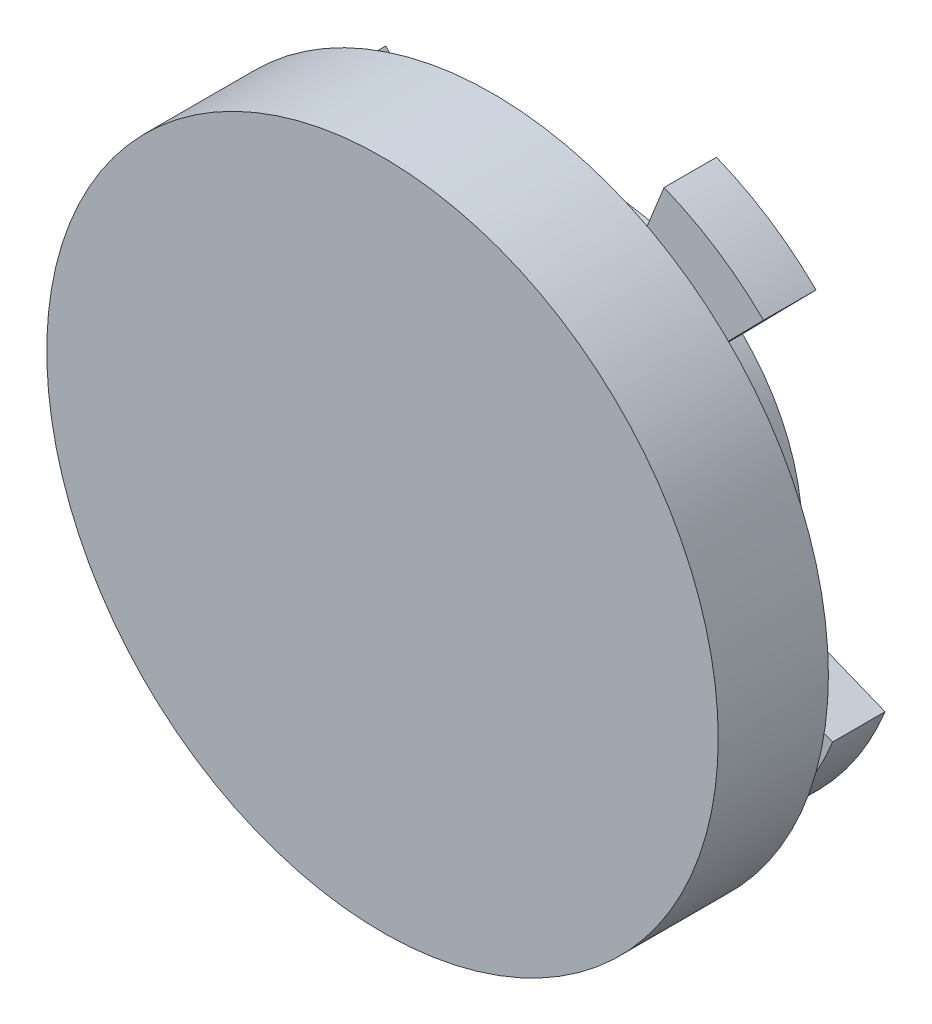
ISO-10303-21;
HEADER;
FILE_DESCRIPTION(('STEP AP214'),'2;1');
FILE_NAME('part.step','',(''),(''),'','','');
FILE_SCHEMA(('AUTOMOTIVE_DESIGN { 1 0 10303 214 1 1 1 1 }'));
ENDSEC;
DATA;
#1=APPLICATION_CONTEXT('core data for automotive mechanical design processes');
#2=APPLICATION_PROTOCOL_DEFINITION('international standard','automotive_design',2000,#1);
#3=PRODUCT_CONTEXT('',#1,'mechanical');
#4=PRODUCT('Part','Part','',(#3));
#5=PRODUCT_RELATED_PRODUCT_CATEGORY('part','',(#4));
#6=PRODUCT_DEFINITION_FORMATION('','',#4);
#7=PRODUCT_DEFINITION_CONTEXT('part definition',#1,'design');
#8=PRODUCT_DEFINITION('design','',#6,#7);
#9=PRODUCT_DEFINITION_SHAPE('','',#8);
#10=(LENGTH_UNIT() NAMED_UNIT(*) SI_UNIT(.MILLI.,.METRE.));
#11=(NAMED_UNIT(*) PLANE_ANGLE_UNIT() SI_UNIT($,.RADIAN.));
#12=(NAMED_UNIT(*) SI_UNIT($,.STERADIAN.) SOLID_ANGLE_UNIT());
#13=UNCERTAINTY_MEASURE_WITH_UNIT(LENGTH_MEASURE(1.E-05),#10,'distance_accuracy_value','');
#14=(GEOMETRIC_REPRESENTATION_CONTEXT(3) GLOBAL_UNCERTAINTY_ASSIGNED_CONTEXT((#13)) GLOBAL_UNIT_ASSIGNED_CONTEXT((#10,
#11,#12)) REPRESENTATION_CONTEXT('',''));
#15=CARTESIAN_POINT('',(0.,0.,0.));
#16=DIRECTION('',(0.,0.,1.));
#17=DIRECTION('',(1.,0.,0.));
#18=AXIS2_PLACEMENT_3D('',#15,#16,#17);
#19=CARTESIAN_POINT('',(0.,0.,2.5));
#20=DIRECTION('',(0.,0.,-1.));
#21=DIRECTION('',(-1.,0.,0.));
#22=AXIS2_PLACEMENT_3D('',#19,#20,#21);
#23=CYLINDRICAL_SURFACE('',#22,9.5);
#24=CARTESIAN_POINT('',(0.,0.,0.));
#25=DIRECTION('',(0.,0.,1.));
#26=DIRECTION('',(1.,0.,0.));
#27=AXIS2_PLACEMENT_3D('',#24,#25,#26);
#28=CIRCLE('',#27,9.5);
#29=CARTESIAN_POINT('',(8.81195121073412,-3.54957967365734,0.));
#30=VERTEX_POINT('',#29);
#31=CARTESIAN_POINT('',(6.6563059929086,6.77817014604746,0.));
#32=VERTEX_POINT('',#31);
#33=EDGE_CURVE('E105',#30,#32,#28,.T.);
#34=ORIENTED_EDGE('',*,*,#33,.T.);
#35=DIRECTION('',(0.,0.,-1.));
#36=VECTOR('',#35,1.);
#37=CARTESIAN_POINT('',(6.6563059929086,6.77817014604746,2.5));
#38=LINE('',#37,#36);
#39=CARTESIAN_POINT('',(6.6563059929086,6.77817014604746,2.5));
#40=VERTEX_POINT('',#39);
#41=EDGE_CURVE('E218',#40,#32,#38,.T.);
#42=ORIENTED_EDGE('',*,*,#41,.F.);
#43=CARTESIAN_POINT('',(0.,0.,2.5));
#44=DIRECTION('',(0.,0.,1.));
#45=DIRECTION('',(1.,0.,0.));
#46=AXIS2_PLACEMENT_3D('',#43,#44,#45);
#47=CIRCLE('',#46,9.5);
#48=CARTESIAN_POINT('',(3.54957967365734,8.81195121073412,2.5));
#49=VERTEX_POINT('',#48);
#50=EDGE_CURVE('E189',#40,#49,#47,.T.);
#51=ORIENTED_EDGE('',*,*,#50,.T.);
#52=DIRECTION('',(0.,0.,-1.));
#53=VECTOR('',#52,1.);
#54=CARTESIAN_POINT('',(3.54957967365734,8.81195121073412,2.5));
#55=LINE('',#54,#53);
#56=CARTESIAN_POINT('',(3.54957967365734,8.81195121073412,0.));
#57=VERTEX_POINT('',#56);
#58=EDGE_CURVE('E249',#49,#57,#55,.T.);
#59=ORIENTED_EDGE('',*,*,#58,.T.);
#60=CARTESIAN_POINT('',(0.,0.,0.));
#61=DIRECTION('',(0.,0.,1.));
#62=DIRECTION('',(1.,0.,0.));
#63=AXIS2_PLACEMENT_3D('',#60,#61,#62);
#64=CIRCLE('',#63,9.5);
#65=CARTESIAN_POINT('',(-6.77817014604745,6.6563059929086,0.));
#66=VERTEX_POINT('',#65);
#67=EDGE_CURVE('E191',#57,#66,#64,.T.);
#68=ORIENTED_EDGE('',*,*,#67,.T.);
#69=DIRECTION('',(0.,0.,-1.));
#70=VECTOR('',#69,1.);
#71=CARTESIAN_POINT('',(-6.77817014604745,6.6563059929086,2.5));
#72=LINE('',#71,#70);
#73=CARTESIAN_POINT('',(-6.77817014604745,6.6563059929086,2.5));
#74=VERTEX_POINT('',#73);
#75=EDGE_CURVE('E246',#74,#66,#72,.T.);
#76=ORIENTED_EDGE('',*,*,#75,.F.);
#77=CARTESIAN_POINT('',(-8.81195121073413,3.54957967365734,2.5));
#78=VERTEX_POINT('',#77);
#79=EDGE_CURVE('E42',#74,#78,#47,.T.);
#80=ORIENTED_EDGE('',*,*,#79,.T.);
#81=DIRECTION('',(0.,0.,-1.));
#82=VECTOR('',#81,1.);
#83=CARTESIAN_POINT('',(-8.81195121073413,3.54957967365734,2.5));
#84=LINE('',#83,#82);
#85=CARTESIAN_POINT('',(-8.81195121073413,3.54957967365734,0.));
#86=VERTEX_POINT('',#85);
#87=EDGE_CURVE('E237',#78,#86,#84,.T.);
#88=ORIENTED_EDGE('',*,*,#87,.T.);
#89=CARTESIAN_POINT('',(0.,0.,0.));
#90=DIRECTION('',(0.,0.,1.));
#91=DIRECTION('',(1.,0.,0.));
#92=AXIS2_PLACEMENT_3D('',#89,#90,#91);
#93=CIRCLE('',#92,9.5);
#94=CARTESIAN_POINT('',(-6.6563059929086,-6.77817014604745,0.));
#95=VERTEX_POINT('',#94);
#96=EDGE_CURVE('E199',#86,#95,#93,.T.);
#97=ORIENTED_EDGE('',*,*,#96,.T.);
#98=DIRECTION('',(0.,0.,-1.));
#99=VECTOR('',#98,1.);
#100=CARTESIAN_POINT('',(-6.6563059929086,-6.77817014604745,2.5));
#101=LINE('',#100,#99);
#102=CARTESIAN_POINT('',(-6.6563059929086,-6.77817014604745,2.5));
#103=VERTEX_POINT('',#102);
#104=EDGE_CURVE('E234',#103,#95,#101,.T.);
#105=ORIENTED_EDGE('',*,*,#104,.F.);
#106=CARTESIAN_POINT('',(-3.54957967365734,-8.81195121073412,2.5));
#107=VERTEX_POINT('',#106);
#108=EDGE_CURVE('E254',#103,#107,#47,.T.);
#109=ORIENTED_EDGE('',*,*,#108,.T.);
#110=DIRECTION('',(0.,0.,-1.));
#111=VECTOR('',#110,1.);
#112=CARTESIAN_POINT('',(-3.54957967365734,-8.81195121073412,2.5));
#113=LINE('',#112,#111);
#114=CARTESIAN_POINT('',(-3.54957967365734,-8.81195121073412,0.));
#115=VERTEX_POINT('',#114);
#116=EDGE_CURVE('E225',#107,#115,#113,.T.);
#117=ORIENTED_EDGE('',*,*,#116,.T.);
#118=CARTESIAN_POINT('',(0.,0.,0.));
#119=DIRECTION('',(0.,0.,1.));
#120=DIRECTION('',(1.,0.,0.));
#121=AXIS2_PLACEMENT_3D('',#118,#119,#120);
#122=CIRCLE('',#121,9.5);
#123=CARTESIAN_POINT('',(6.77817014604745,-6.6563059929086,0.));
#124=VERTEX_POINT('',#123);
#125=EDGE_CURVE('E207',#115,#124,#122,.T.);
#126=ORIENTED_EDGE('',*,*,#125,.T.);
#127=DIRECTION('',(0.,0.,-1.));
#128=VECTOR('',#127,1.);
#129=CARTESIAN_POINT('',(6.77817014604745,-6.6563059929086,2.5));
#130=LINE('',#129,#128);
#131=CARTESIAN_POINT('',(6.77817014604745,-6.6563059929086,2.5));
#132=VERTEX_POINT('',#131);
#133=EDGE_CURVE('E222',#132,#124,#130,.T.);
#134=ORIENTED_EDGE('',*,*,#133,.F.);
#135=CARTESIAN_POINT('',(8.81195121073412,-3.54957967365734,2.5));
#136=VERTEX_POINT('',#135);
#137=EDGE_CURVE('E252',#132,#136,#47,.T.);
#138=ORIENTED_EDGE('',*,*,#137,.T.);
#139=DIRECTION('',(0.,0.,-1.));
#140=VECTOR('',#139,1.);
#141=CARTESIAN_POINT('',(8.81195121073412,-3.54957967365734,2.5));
#142=LINE('',#141,#140);
#143=EDGE_CURVE('E176',#136,#30,#142,.T.);
#144=ORIENTED_EDGE('',*,*,#143,.T.);
#145=EDGE_LOOP('',(#34,#42,#51,#59,#68,#76,#80,#88,#97,#105,#109,#117,#126,#134,#138,#144));
#146=FACE_BOUND('',#145,.T.);
#147=CARTESIAN_POINT('',(0.,0.,5.25));
#148=DIRECTION('',(0.,0.,1.));
#149=DIRECTION('',(1.,0.,0.));
#150=AXIS2_PLACEMENT_3D('',#147,#148,#149);
#151=CIRCLE('',#150,9.5);
#152=CARTESIAN_POINT('',(9.5,0.,5.25));
#153=VERTEX_POINT('',#152);
#154=EDGE_CURVE('E11',#153,#153,#151,.T.);
#155=ORIENTED_EDGE('',*,*,#154,.F.);
#156=EDGE_LOOP('',(#155));
#157=FACE_BOUND('',#156,.T.);
#158=ADVANCED_FACE('F33',(#146,#157),#23,.T.);
#159=CARTESIAN_POINT('',(0.,0.,2.5));
#160=DIRECTION('',(0.,0.,1.));
#161=DIRECTION('',(1.,0.,0.));
#162=AXIS2_PLACEMENT_3D('',#159,#160,#161);
#163=PLANE('',#162);
#164=ORIENTED_EDGE('',*,*,#50,.F.);
#165=DIRECTION('',(0.700663788727222,0.713491594320784,0.));
#166=VECTOR('',#165,1.);
#167=CARTESIAN_POINT('',(10.1596249365447,10.3456281176514,2.5));
#168=LINE('',#167,#166);
#169=CARTESIAN_POINT('',(10.1596249365447,10.3456281176514,2.5));
#170=VERTEX_POINT('',#169);
#171=EDGE_CURVE('E50',#40,#170,#168,.T.);
#172=ORIENTED_EDGE('',*,*,#171,.T.);
#173=CARTESIAN_POINT('',(0.,0.,2.5));
#174=DIRECTION('',(0.,0.,1.));
#175=DIRECTION('',(1.,0.,0.));
#176=AXIS2_PLACEMENT_3D('',#173,#174,#175);
#177=CIRCLE('',#176,14.5);
#178=CARTESIAN_POINT('',(5.41777950189805,13.4498202690152,2.5));
#179=VERTEX_POINT('',#178);
#180=EDGE_CURVE('E216',#170,#179,#177,.T.);
#181=ORIENTED_EDGE('',*,*,#180,.T.);
#182=DIRECTION('',(-0.373639965648141,-0.927573811656224,0.));
#183=VECTOR('',#182,1.);
#184=CARTESIAN_POINT('',(5.41777950189805,13.4498202690152,2.5));
#185=LINE('',#184,#183);
#186=EDGE_CURVE('E120',#179,#49,#185,.T.);
#187=ORIENTED_EDGE('',*,*,#186,.T.);
#188=EDGE_LOOP('',(#164,#172,#181,#187));
#189=FACE_BOUND('',#188,.T.);
#190=ADVANCED_FACE('F325',(#189),#163,.T.);
#191=ORIENTED_EDGE('',*,*,#79,.F.);
#192=DIRECTION('',(-0.713491594320785,0.700663788727222,0.));
#193=VECTOR('',#192,1.);
#194=CARTESIAN_POINT('',(-10.3456281176514,10.1596249365447,2.5));
#195=LINE('',#194,#193);
#196=CARTESIAN_POINT('',(-10.3456281176514,10.1596249365447,2.5));
#197=VERTEX_POINT('',#196);
#198=EDGE_CURVE('E272',#74,#197,#195,.T.);
#199=ORIENTED_EDGE('',*,*,#198,.T.);
#200=CARTESIAN_POINT('',(0.,0.,2.5));
#201=DIRECTION('',(0.,0.,1.));
#202=DIRECTION('',(1.,0.,0.));
#203=AXIS2_PLACEMENT_3D('',#200,#201,#202);
#204=CIRCLE('',#203,14.5);
#205=CARTESIAN_POINT('',(-13.4498202690152,5.41777950189804,2.5));
#206=VERTEX_POINT('',#205);
#207=EDGE_CURVE('E277',#197,#206,#204,.T.);
#208=ORIENTED_EDGE('',*,*,#207,.T.);
#209=DIRECTION('',(0.927573811656224,-0.373639965648141,0.));
#210=VECTOR('',#209,1.);
#211=CARTESIAN_POINT('',(-13.4498202690152,5.41777950189804,2.5));
#212=LINE('',#211,#210);
#213=EDGE_CURVE('E275',#206,#78,#212,.T.);
#214=ORIENTED_EDGE('',*,*,#213,.T.);
#215=EDGE_LOOP('',(#191,#199,#208,#214));
#216=FACE_BOUND('',#215,.T.);
#217=ADVANCED_FACE('F271',(#216),#163,.T.);
#218=ORIENTED_EDGE('',*,*,#108,.F.);
#219=DIRECTION('',(-0.700663788727222,-0.713491594320784,0.));
#220=VECTOR('',#219,1.);
#221=CARTESIAN_POINT('',(-10.1596249365447,-10.3456281176514,2.5));
#222=LINE('',#221,#220);
#223=CARTESIAN_POINT('',(-10.1596249365447,-10.3456281176514,2.5));
#224=VERTEX_POINT('',#223);
#225=EDGE_CURVE('E280',#103,#224,#222,.T.);
#226=ORIENTED_EDGE('',*,*,#225,.T.);
#227=CARTESIAN_POINT('',(0.,0.,2.5));
#228=DIRECTION('',(0.,0.,1.));
#229=DIRECTION('',(1.,0.,0.));
#230=AXIS2_PLACEMENT_3D('',#227,#228,#229);
#231=CIRCLE('',#230,14.5);
#232=CARTESIAN_POINT('',(-5.41777950189805,-13.4498202690152,2.5));
#233=VERTEX_POINT('',#232);
#234=EDGE_CURVE('E298',#224,#233,#231,.T.);
#235=ORIENTED_EDGE('',*,*,#234,.T.);
#236=DIRECTION('',(0.37363996564814,0.927573811656224,0.));
#237=VECTOR('',#236,1.);
#238=CARTESIAN_POINT('',(-5.41777950189804,-13.4498202690152,2.5));
#239=LINE('',#238,#237);
#240=EDGE_CURVE('E300',#233,#107,#239,.T.);
#241=ORIENTED_EDGE('',*,*,#240,.T.);
#242=EDGE_LOOP('',(#218,#226,#235,#241));
#243=FACE_BOUND('',#242,.T.);
#244=ADVANCED_FACE('F306',(#243),#163,.T.);
#245=CARTESIAN_POINT('',(0.,0.,2.5));
#246=DIRECTION('',(0.,0.,-1.));
#247=DIRECTION('',(-1.,0.,0.));
#248=AXIS2_PLACEMENT_3D('',#245,#246,#247);
#249=CYLINDRICAL_SURFACE('',#248,14.5);
#250=CARTESIAN_POINT('',(0.,0.,0.));
#251=DIRECTION('',(0.,0.,1.));
#252=DIRECTION('',(1.,0.,0.));
#253=AXIS2_PLACEMENT_3D('',#250,#251,#252);
#254=CIRCLE('',#253,14.5);
#255=CARTESIAN_POINT('',(10.1596249365447,10.3456281176514,0.));
#256=VERTEX_POINT('',#255);
#257=CARTESIAN_POINT('',(5.41777950189805,13.4498202690152,0.));
#258=VERTEX_POINT('',#257);
#259=EDGE_CURVE('E185',#256,#258,#254,.T.);
#260=ORIENTED_EDGE('',*,*,#259,.T.);
#261=DIRECTION('',(0.,0.,-1.));
#262=VECTOR('',#261,1.);
#263=CARTESIAN_POINT('',(5.41777950189805,13.4498202690152,2.5));
#264=LINE('',#263,#262);
#265=EDGE_CURVE('E251',#179,#258,#264,.T.);
#266=ORIENTED_EDGE('',*,*,#265,.F.);
#267=ORIENTED_EDGE('',*,*,#180,.F.);
#268=DIRECTION('',(0.,0.,-1.));
#269=VECTOR('',#268,1.);
#270=CARTESIAN_POINT('',(10.1596249365447,10.3456281176514,2.5));
#271=LINE('',#270,#269);
#272=EDGE_CURVE('E181',#170,#256,#271,.T.);
#273=ORIENTED_EDGE('',*,*,#272,.T.);
#274=EDGE_LOOP('',(#260,#266,#267,#273));
#275=FACE_BOUND('',#274,.T.);
#276=ADVANCED_FACE('F35',(#275),#249,.T.);
#277=CARTESIAN_POINT('',(5.41777950189805,13.4498202690152,2.5));
#278=DIRECTION('',(0.927573811656224,-0.373639965648141,0.));
#279=DIRECTION('',(0.373639965648141,0.927573811656224,0.));
#280=AXIS2_PLACEMENT_3D('',#277,#278,#279);
#281=PLANE('',#280);
#282=DIRECTION('',(-0.373639965648141,-0.927573811656224,0.));
#283=VECTOR('',#282,1.);
#284=CARTESIAN_POINT('',(5.41777950189805,13.4498202690152,0.));
#285=LINE('',#284,#283);
#286=EDGE_CURVE('E188',#258,#57,#285,.T.);
#287=ORIENTED_EDGE('',*,*,#286,.T.);
#288=ORIENTED_EDGE('',*,*,#58,.F.);
#289=ORIENTED_EDGE('',*,*,#186,.F.);
#290=ORIENTED_EDGE('',*,*,#265,.T.);
#291=EDGE_LOOP('',(#287,#288,#289,#290));
#292=FACE_BOUND('',#291,.T.);
#293=ADVANCED_FACE('F352',(#292),#281,.F.);
#294=CARTESIAN_POINT('',(-10.3456281176514,10.1596249365447,2.5));
#295=DIRECTION('',(-0.700663788727222,-0.713491594320785,0.));
#296=DIRECTION('',(0.713491594320785,-0.700663788727222,0.));
#297=AXIS2_PLACEMENT_3D('',#294,#295,#296);
#298=PLANE('',#297);
#299=DIRECTION('',(-0.713491594320785,0.700663788727222,0.));
#300=VECTOR('',#299,1.);
#301=CARTESIAN_POINT('',(-10.3456281176514,10.1596249365447,0.));
#302=LINE('',#301,#300);
#303=CARTESIAN_POINT('',(-10.3456281176514,10.1596249365447,0.));
#304=VERTEX_POINT('',#303);
#305=EDGE_CURVE('E193',#66,#304,#302,.T.);
#306=ORIENTED_EDGE('',*,*,#305,.T.);
#307=DIRECTION('',(0.,0.,-1.));
#308=VECTOR('',#307,1.);
#309=CARTESIAN_POINT('',(-10.3456281176514,10.1596249365447,2.5));
#310=LINE('',#309,#308);
#311=EDGE_CURVE('E243',#197,#304,#310,.T.);
#312=ORIENTED_EDGE('',*,*,#311,.F.);
#313=ORIENTED_EDGE('',*,*,#198,.F.);
#314=ORIENTED_EDGE('',*,*,#75,.T.);
#315=EDGE_LOOP('',(#306,#312,#313,#314));
#316=FACE_BOUND('',#315,.T.);
#317=ADVANCED_FACE('F404',(#316),#298,.F.);
#318=CARTESIAN_POINT('',(0.,0.,2.5));
#319=DIRECTION('',(0.,0.,-1.));
#320=DIRECTION('',(-1.,0.,0.));
#321=AXIS2_PLACEMENT_3D('',#318,#319,#320);
#322=CYLINDRICAL_SURFACE('',#321,14.5);
#323=CARTESIAN_POINT('',(0.,0.,0.));
#324=DIRECTION('',(0.,0.,1.));
#325=DIRECTION('',(1.,0.,0.));
#326=AXIS2_PLACEMENT_3D('',#323,#324,#325);
#327=CIRCLE('',#326,14.5);
#328=CARTESIAN_POINT('',(-13.4498202690152,5.41777950189804,0.));
#329=VERTEX_POINT('',#328);
#330=EDGE_CURVE('E195',#304,#329,#327,.T.);
#331=ORIENTED_EDGE('',*,*,#330,.T.);
#332=DIRECTION('',(0.,0.,-1.));
#333=VECTOR('',#332,1.);
#334=CARTESIAN_POINT('',(-13.4498202690152,5.41777950189804,2.5));
#335=LINE('',#334,#333);
#336=EDGE_CURVE('E240',#206,#329,#335,.T.);
#337=ORIENTED_EDGE('',*,*,#336,.F.);
#338=ORIENTED_EDGE('',*,*,#207,.F.);
#339=ORIENTED_EDGE('',*,*,#311,.T.);
#340=EDGE_LOOP('',(#331,#337,#338,#339));
#341=FACE_BOUND('',#340,.T.);
#342=ADVANCED_FACE('F399',(#341),#322,.T.);
#343=CARTESIAN_POINT('',(-13.4498202690152,5.41777950189804,2.5));
#344=DIRECTION('',(0.373639965648141,0.927573811656224,0.));
#345=DIRECTION('',(-0.927573811656224,0.373639965648141,0.));
#346=AXIS2_PLACEMENT_3D('',#343,#344,#345);
#347=PLANE('',#346);
#348=DIRECTION('',(0.927573811656224,-0.373639965648141,0.));
#349=VECTOR('',#348,1.);
#350=CARTESIAN_POINT('',(-13.4498202690152,5.41777950189804,0.));
#351=LINE('',#350,#349);
#352=EDGE_CURVE('E197',#329,#86,#351,.T.);
#353=ORIENTED_EDGE('',*,*,#352,.T.);
#354=ORIENTED_EDGE('',*,*,#87,.F.);
#355=ORIENTED_EDGE('',*,*,#213,.F.);
#356=ORIENTED_EDGE('',*,*,#336,.T.);
#357=EDGE_LOOP('',(#353,#354,#355,#356));
#358=FACE_BOUND('',#357,.T.);
#359=ADVANCED_FACE('F282',(#358),#347,.F.);
#360=CARTESIAN_POINT('',(-10.1596249365447,-10.3456281176514,2.5));
#361=DIRECTION('',(0.713491594320784,-0.700663788727222,0.));
#362=DIRECTION('',(0.700663788727222,0.713491594320784,0.));
#363=AXIS2_PLACEMENT_3D('',#360,#361,#362);
#364=PLANE('',#363);
#365=DIRECTION('',(-0.700663788727222,-0.713491594320784,0.));
#366=VECTOR('',#365,1.);
#367=CARTESIAN_POINT('',(-10.1596249365447,-10.3456281176514,0.));
#368=LINE('',#367,#366);
#369=CARTESIAN_POINT('',(-10.1596249365447,-10.3456281176514,0.));
#370=VERTEX_POINT('',#369);
#371=EDGE_CURVE('E201',#95,#370,#368,.T.);
#372=ORIENTED_EDGE('',*,*,#371,.T.);
#373=DIRECTION('',(0.,0.,-1.));
#374=VECTOR('',#373,1.);
#375=CARTESIAN_POINT('',(-10.1596249365447,-10.3456281176514,2.5));
#376=LINE('',#375,#374);
#377=EDGE_CURVE('E231',#224,#370,#376,.T.);
#378=ORIENTED_EDGE('',*,*,#377,.F.);
#379=ORIENTED_EDGE('',*,*,#225,.F.);
#380=ORIENTED_EDGE('',*,*,#104,.T.);
#381=EDGE_LOOP('',(#372,#378,#379,#380));
#382=FACE_BOUND('',#381,.T.);
#383=ADVANCED_FACE('F294',(#382),#364,.F.);
#384=CARTESIAN_POINT('',(0.,0.,2.5));
#385=DIRECTION('',(0.,0.,-1.));
#386=DIRECTION('',(-1.,0.,0.));
#387=AXIS2_PLACEMENT_3D('',#384,#385,#386);
#388=CYLINDRICAL_SURFACE('',#387,14.5);
#389=CARTESIAN_POINT('',(0.,0.,0.));
#390=DIRECTION('',(0.,0.,1.));
#391=DIRECTION('',(1.,0.,0.));
#392=AXIS2_PLACEMENT_3D('',#389,#390,#391);
#393=CIRCLE('',#392,14.5);
#394=CARTESIAN_POINT('',(-5.41777950189805,-13.4498202690152,0.));
#395=VERTEX_POINT('',#394);
#396=EDGE_CURVE('E203',#370,#395,#393,.T.);
#397=ORIENTED_EDGE('',*,*,#396,.T.);
#398=DIRECTION('',(0.,0.,-1.));
#399=VECTOR('',#398,1.);
#400=CARTESIAN_POINT('',(-5.41777950189805,-13.4498202690152,2.5));
#401=LINE('',#400,#399);
#402=EDGE_CURVE('E228',#233,#395,#401,.T.);
#403=ORIENTED_EDGE('',*,*,#402,.F.);
#404=ORIENTED_EDGE('',*,*,#234,.F.);
#405=ORIENTED_EDGE('',*,*,#377,.T.);
#406=EDGE_LOOP('',(#397,#403,#404,#405));
#407=FACE_BOUND('',#406,.T.);
#408=ADVANCED_FACE('F322',(#407),#388,.T.);
#409=CARTESIAN_POINT('',(-5.41777950189804,-13.4498202690152,2.5));
#410=DIRECTION('',(-0.927573811656224,0.37363996564814,0.));
#411=DIRECTION('',(-0.373639965648141,-0.927573811656224,0.));
#412=AXIS2_PLACEMENT_3D('',#409,#410,#411);
#413=PLANE('',#412);
#414=DIRECTION('',(0.37363996564814,0.927573811656224,0.));
#415=VECTOR('',#414,1.);
#416=CARTESIAN_POINT('',(-5.41777950189804,-13.4498202690152,0.));
#417=LINE('',#416,#415);
#418=EDGE_CURVE('E205',#395,#115,#417,.T.);
#419=ORIENTED_EDGE('',*,*,#418,.T.);
#420=ORIENTED_EDGE('',*,*,#116,.F.);
#421=ORIENTED_EDGE('',*,*,#240,.F.);
#422=ORIENTED_EDGE('',*,*,#402,.T.);
#423=EDGE_LOOP('',(#419,#420,#421,#422));
#424=FACE_BOUND('',#423,.T.);
#425=ADVANCED_FACE('F309',(#424),#413,.F.);
#426=CARTESIAN_POINT('',(10.3456281176514,-10.1596249365447,2.5));
#427=DIRECTION('',(0.700663788727222,0.713491594320784,0.));
#428=DIRECTION('',(-0.713491594320784,0.700663788727222,0.));
#429=AXIS2_PLACEMENT_3D('',#426,#427,#428);
#430=PLANE('',#429);
#431=DIRECTION('',(0.713491594320784,-0.700663788727222,0.));
#432=VECTOR('',#431,1.);
#433=CARTESIAN_POINT('',(10.3456281176514,-10.1596249365447,0.));
#434=LINE('',#433,#432);
#435=CARTESIAN_POINT('',(10.3456281176514,-10.1596249365447,0.));
#436=VERTEX_POINT('',#435);
#437=EDGE_CURVE('E209',#124,#436,#434,.T.);
#438=ORIENTED_EDGE('',*,*,#437,.T.);
#439=DIRECTION('',(0.,0.,-1.));
#440=VECTOR('',#439,1.);
#441=CARTESIAN_POINT('',(10.3456281176514,-10.1596249365447,2.5));
#442=LINE('',#441,#440);
#443=CARTESIAN_POINT('',(10.3456281176514,-10.1596249365447,2.5));
#444=VERTEX_POINT('',#443);
#445=EDGE_CURVE('E175',#444,#436,#442,.T.);
#446=ORIENTED_EDGE('',*,*,#445,.F.);
#447=DIRECTION('',(0.713491594320784,-0.700663788727222,0.));
#448=VECTOR('',#447,1.);
#449=CARTESIAN_POINT('',(10.3456281176514,-10.1596249365447,2.5));
#450=LINE('',#449,#448);
#451=EDGE_CURVE('E163',#132,#444,#450,.T.);
#452=ORIENTED_EDGE('',*,*,#451,.F.);
#453=ORIENTED_EDGE('',*,*,#133,.T.);
#454=EDGE_LOOP('',(#438,#446,#452,#453));
#455=FACE_BOUND('',#454,.T.);
#456=ADVANCED_FACE('F314',(#455),#430,.F.);
#457=CARTESIAN_POINT('',(0.,0.,2.5));
#458=DIRECTION('',(0.,0.,-1.));
#459=DIRECTION('',(-1.,0.,0.));
#460=AXIS2_PLACEMENT_3D('',#457,#458,#459);
#461=CYLINDRICAL_SURFACE('',#460,14.5);
#462=CARTESIAN_POINT('',(0.,0.,0.));
#463=DIRECTION('',(0.,0.,1.));
#464=DIRECTION('',(1.,0.,0.));
#465=AXIS2_PLACEMENT_3D('',#462,#463,#464);
#466=CIRCLE('',#465,14.5);
#467=CARTESIAN_POINT('',(13.4498202690152,-5.41777950189804,0.));
#468=VERTEX_POINT('',#467);
#469=EDGE_CURVE('E172',#436,#468,#466,.T.);
#470=ORIENTED_EDGE('',*,*,#469,.T.);
#471=DIRECTION('',(0.,0.,-1.));
#472=VECTOR('',#471,1.);
#473=CARTESIAN_POINT('',(13.4498202690152,-5.41777950189804,2.5));
#474=LINE('',#473,#472);
#475=CARTESIAN_POINT('',(13.4498202690152,-5.41777950189804,2.5));
#476=VERTEX_POINT('',#475);
#477=EDGE_CURVE('E169',#476,#468,#474,.T.);
#478=ORIENTED_EDGE('',*,*,#477,.F.);
#479=CARTESIAN_POINT('',(0.,0.,2.5));
#480=DIRECTION('',(0.,0.,1.));
#481=DIRECTION('',(1.,0.,0.));
#482=AXIS2_PLACEMENT_3D('',#479,#480,#481);
#483=CIRCLE('',#482,14.5);
#484=EDGE_CURVE('E156',#444,#476,#483,.T.);
#485=ORIENTED_EDGE('',*,*,#484,.F.);
#486=ORIENTED_EDGE('',*,*,#445,.T.);
#487=EDGE_LOOP('',(#470,#478,#485,#486));
#488=FACE_BOUND('',#487,.T.);
#489=ADVANCED_FACE('F170',(#488),#461,.T.);
#490=CARTESIAN_POINT('',(13.4498202690152,-5.41777950189804,2.5));
#491=DIRECTION('',(-0.373639965648141,-0.927573811656224,0.));
#492=DIRECTION('',(0.927573811656224,-0.373639965648141,0.));
#493=AXIS2_PLACEMENT_3D('',#490,#491,#492);
#494=PLANE('',#493);
#495=DIRECTION('',(-0.927573811656224,0.373639965648141,0.));
#496=VECTOR('',#495,1.);
#497=CARTESIAN_POINT('',(13.4498202690152,-5.41777950189804,0.));
#498=LINE('',#497,#496);
#499=EDGE_CURVE('E212',#468,#30,#498,.T.);
#500=ORIENTED_EDGE('',*,*,#499,.T.);
#501=ORIENTED_EDGE('',*,*,#143,.F.);
#502=DIRECTION('',(-0.927573811656224,0.373639965648141,0.));
#503=VECTOR('',#502,1.);
#504=CARTESIAN_POINT('',(13.4498202690152,-5.41777950189804,2.5));
#505=LINE('',#504,#503);
#506=EDGE_CURVE('E160',#476,#136,#505,.T.);
#507=ORIENTED_EDGE('',*,*,#506,.F.);
#508=ORIENTED_EDGE('',*,*,#477,.T.);
#509=EDGE_LOOP('',(#500,#501,#507,#508));
#510=FACE_BOUND('',#509,.T.);
#511=ADVANCED_FACE('F178',(#510),#494,.F.);
#512=CARTESIAN_POINT('',(10.1596249365447,10.3456281176514,2.5));
#513=DIRECTION('',(-0.713491594320784,0.700663788727222,0.));
#514=DIRECTION('',(-0.700663788727222,-0.713491594320784,0.));
#515=AXIS2_PLACEMENT_3D('',#512,#513,#514);
#516=PLANE('',#515);
#517=DIRECTION('',(0.700663788727222,0.713491594320784,0.));
#518=VECTOR('',#517,1.);
#519=CARTESIAN_POINT('',(10.1596249365447,10.3456281176514,0.));
#520=LINE('',#519,#518);
#521=EDGE_CURVE('E111',#32,#256,#520,.T.);
#522=ORIENTED_EDGE('',*,*,#521,.T.);
#523=ORIENTED_EDGE('',*,*,#272,.F.);
#524=ORIENTED_EDGE('',*,*,#171,.F.);
#525=ORIENTED_EDGE('',*,*,#41,.T.);
#526=EDGE_LOOP('',(#522,#523,#524,#525));
#527=FACE_BOUND('',#526,.T.);
#528=ADVANCED_FACE('F333',(#527),#516,.F.);
#529=ORIENTED_EDGE('',*,*,#137,.F.);
#530=ORIENTED_EDGE('',*,*,#451,.T.);
#531=ORIENTED_EDGE('',*,*,#484,.T.);
#532=ORIENTED_EDGE('',*,*,#506,.T.);
#533=EDGE_LOOP('',(#529,#530,#531,#532));
#534=FACE_BOUND('',#533,.T.);
#535=ADVANCED_FACE('F158',(#534),#163,.T.);
#536=CARTESIAN_POINT('',(0.,0.,0.));
#537=DIRECTION('',(0.,0.,1.));
#538=DIRECTION('',(1.,0.,0.));
#539=AXIS2_PLACEMENT_3D('',#536,#537,#538);
#540=PLANE('',#539);
#541=ORIENTED_EDGE('',*,*,#259,.F.);
#542=ORIENTED_EDGE('',*,*,#521,.F.);
#543=ORIENTED_EDGE('',*,*,#33,.F.);
#544=ORIENTED_EDGE('',*,*,#499,.F.);
#545=ORIENTED_EDGE('',*,*,#469,.F.);
#546=ORIENTED_EDGE('',*,*,#437,.F.);
#547=ORIENTED_EDGE('',*,*,#125,.F.);
#548=ORIENTED_EDGE('',*,*,#418,.F.);
#549=ORIENTED_EDGE('',*,*,#396,.F.);
#550=ORIENTED_EDGE('',*,*,#371,.F.);
#551=ORIENTED_EDGE('',*,*,#96,.F.);
#552=ORIENTED_EDGE('',*,*,#352,.F.);
#553=ORIENTED_EDGE('',*,*,#330,.F.);
#554=ORIENTED_EDGE('',*,*,#305,.F.);
#555=ORIENTED_EDGE('',*,*,#67,.F.);
#556=ORIENTED_EDGE('',*,*,#286,.F.);
#557=EDGE_LOOP('',(#541,#542,#543,#544,#545,#546,#547,#548,#549,#550,#551,#552,#553,#554,#555,#556));
#558=FACE_BOUND('',#557,.T.);
#559=ADVANCED_FACE('F287',(#558),#540,.F.);
#560=CARTESIAN_POINT('',(0.,0.,5.25));
#561=DIRECTION('',(0.,0.,1.));
#562=DIRECTION('',(1.,0.,0.));
#563=AXIS2_PLACEMENT_3D('',#560,#561,#562);
#564=CYLINDRICAL_SURFACE('',#563,16.);
#565=CARTESIAN_POINT('',(0.,0.,5.25));
#566=DIRECTION('',(0.,0.,1.));
#567=DIRECTION('',(1.,0.,0.));
#568=AXIS2_PLACEMENT_3D('',#565,#566,#567);
#569=CIRCLE('',#568,16.);
#570=CARTESIAN_POINT('',(16.,0.,5.25));
#571=VERTEX_POINT('',#570);
#572=EDGE_CURVE('E261',#571,#571,#569,.T.);
#573=ORIENTED_EDGE('',*,*,#572,.T.);
#574=EDGE_LOOP('',(#573));
#575=FACE_BOUND('',#574,.T.);
#576=CARTESIAN_POINT('',(0.,0.,10.5));
#577=DIRECTION('',(0.,0.,1.));
#578=DIRECTION('',(1.,0.,0.));
#579=AXIS2_PLACEMENT_3D('',#576,#577,#578);
#580=CIRCLE('',#579,16.);
#581=CARTESIAN_POINT('',(16.,0.,10.5));
#582=VERTEX_POINT('',#581);
#583=EDGE_CURVE('E263',#582,#582,#580,.T.);
#584=ORIENTED_EDGE('',*,*,#583,.F.);
#585=EDGE_LOOP('',(#584));
#586=FACE_BOUND('',#585,.T.);
#587=ADVANCED_FACE('F345',(#575,#586),#564,.T.);
#588=CARTESIAN_POINT('',(0.,0.,5.25));
#589=DIRECTION('',(0.,0.,1.));
#590=DIRECTION('',(1.,0.,0.));
#591=AXIS2_PLACEMENT_3D('',#588,#589,#590);
#592=PLANE('',#591);
#593=ORIENTED_EDGE('',*,*,#154,.T.);
#594=EDGE_LOOP('',(#593));
#595=FACE_BOUND('',#594,.T.);
#596=ORIENTED_EDGE('',*,*,#572,.F.);
#597=EDGE_LOOP('',(#596));
#598=FACE_BOUND('',#597,.T.);
#599=ADVANCED_FACE('F466',(#595,#598),#592,.F.);
#600=CARTESIAN_POINT('',(0.,0.,10.5));
#601=DIRECTION('',(0.,0.,1.));
#602=DIRECTION('',(1.,0.,0.));
#603=AXIS2_PLACEMENT_3D('',#600,#601,#602);
#604=PLANE('',#603);
#605=ORIENTED_EDGE('',*,*,#583,.T.);
#606=EDGE_LOOP('',(#605));
#607=FACE_BOUND('',#606,.T.);
#608=ADVANCED_FACE('F475',(#607),#604,.T.);
#609=CLOSED_SHELL('',(#158,#190,#217,#244,#276,#293,#317,#342,#359,#383,#408,#425,#456,#489,
#511,#528,#535,#559,#587,#599,#608));
#610=MANIFOLD_SOLID_BREP('B2',#609);
#611=ADVANCED_BREP_SHAPE_REPRESENTATION('',(#18,#610),#14);
#612=SHAPE_DEFINITION_REPRESENTATION(#9,#611);
ENDSEC;
END-ISO-10303-21;
